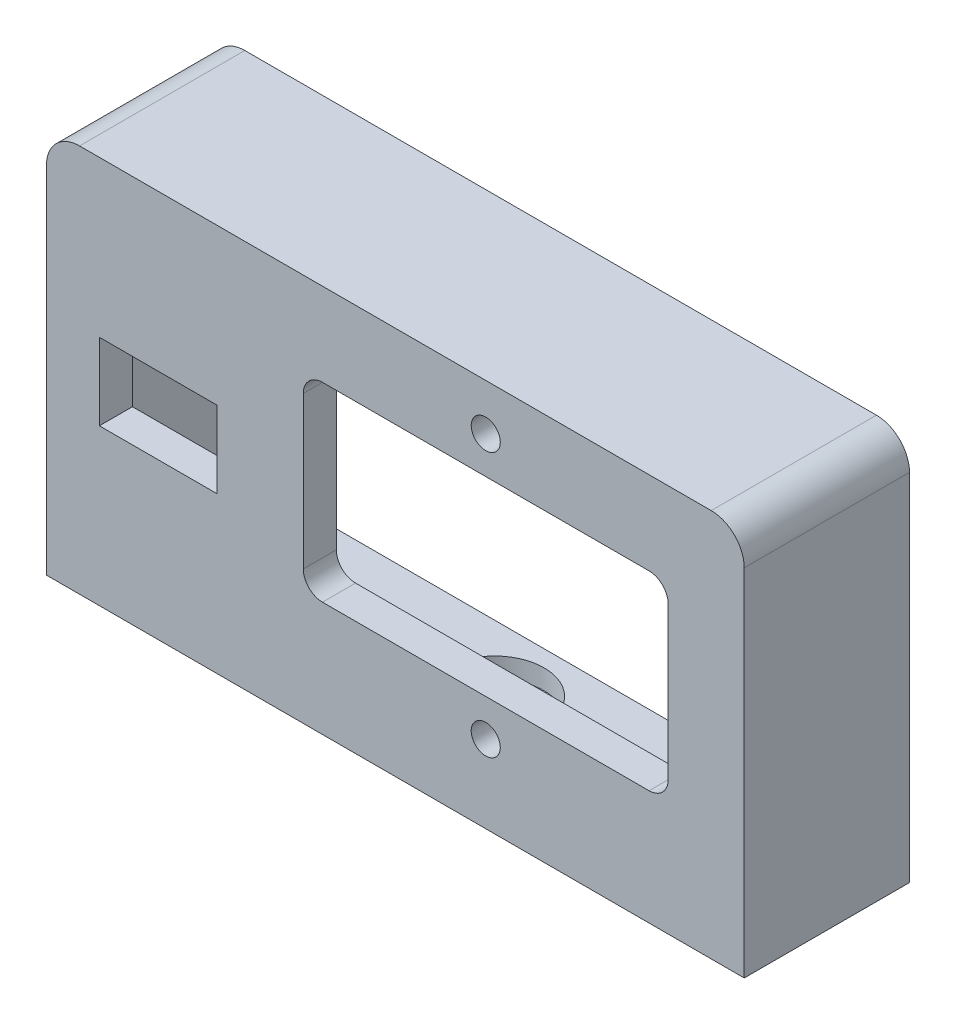
ISO-10303-21;
HEADER;
FILE_DESCRIPTION(('STEP AP214'),'2;1');
FILE_NAME('part.step','',(''),(''),'','','');
FILE_SCHEMA(('AUTOMOTIVE_DESIGN { 1 0 10303 214 1 1 1 1 }'));
ENDSEC;
DATA;
#1=APPLICATION_CONTEXT('core data for automotive mechanical design processes');
#2=APPLICATION_PROTOCOL_DEFINITION('international standard','automotive_design',2000,#1);
#3=PRODUCT_CONTEXT('',#1,'mechanical');
#4=PRODUCT('Part','Part','',(#3));
#5=PRODUCT_RELATED_PRODUCT_CATEGORY('part','',(#4));
#6=PRODUCT_DEFINITION_FORMATION('','',#4);
#7=PRODUCT_DEFINITION_CONTEXT('part definition',#1,'design');
#8=PRODUCT_DEFINITION('design','',#6,#7);
#9=PRODUCT_DEFINITION_SHAPE('','',#8);
#10=(LENGTH_UNIT() NAMED_UNIT(*) SI_UNIT(.MILLI.,.METRE.));
#11=(NAMED_UNIT(*) PLANE_ANGLE_UNIT() SI_UNIT($,.RADIAN.));
#12=(NAMED_UNIT(*) SI_UNIT($,.STERADIAN.) SOLID_ANGLE_UNIT());
#13=UNCERTAINTY_MEASURE_WITH_UNIT(LENGTH_MEASURE(1.E-05),#10,'distance_accuracy_value','');
#14=(GEOMETRIC_REPRESENTATION_CONTEXT(3) GLOBAL_UNCERTAINTY_ASSIGNED_CONTEXT((#13)) GLOBAL_UNIT_ASSIGNED_CONTEXT((#10,
#11,#12)) REPRESENTATION_CONTEXT('',''));
#15=CARTESIAN_POINT('',(0.,0.,0.));
#16=DIRECTION('',(0.,0.,1.));
#17=DIRECTION('',(1.,0.,0.));
#18=AXIS2_PLACEMENT_3D('',#15,#16,#17);
#19=CARTESIAN_POINT('',(0.,0.,5.));
#20=DIRECTION('',(0.,0.,1.));
#21=DIRECTION('',(1.,0.,0.));
#22=AXIS2_PLACEMENT_3D('',#19,#20,#21);
#23=PLANE('',#22);
#24=DIRECTION('',(0.,-1.,0.));
#25=VECTOR('',#24,1.);
#26=CARTESIAN_POINT('',(-39.8681999570055,-54.3939858142769,5.));
#27=LINE('',#26,#25);
#28=CARTESIAN_POINT('',(-39.8681999570055,-54.3939858142769,5.));
#29=VERTEX_POINT('',#28);
#30=CARTESIAN_POINT('',(-39.8681999570055,-65.9939858142769,5.));
#31=VERTEX_POINT('',#30);
#32=EDGE_CURVE('E270',#29,#31,#27,.T.);
#33=ORIENTED_EDGE('',*,*,#32,.F.);
#34=DIRECTION('',(-1.,0.,0.));
#35=VECTOR('',#34,1.);
#36=CARTESIAN_POINT('',(-39.8681999570055,-54.3939858142769,5.));
#37=LINE('',#36,#35);
#38=CARTESIAN_POINT('',(-22.0681999570055,-54.3939858142769,5.));
#39=VERTEX_POINT('',#38);
#40=EDGE_CURVE('E278',#39,#29,#37,.T.);
#41=ORIENTED_EDGE('',*,*,#40,.F.);
#42=DIRECTION('',(0.,1.,0.));
#43=VECTOR('',#42,1.);
#44=CARTESIAN_POINT('',(-22.0681999570055,-54.3939858142769,5.));
#45=LINE('',#44,#43);
#46=CARTESIAN_POINT('',(-22.0681999570055,-65.9939858142769,5.));
#47=VERTEX_POINT('',#46);
#48=EDGE_CURVE('E275',#47,#39,#45,.T.);
#49=ORIENTED_EDGE('',*,*,#48,.F.);
#50=DIRECTION('',(1.,0.,0.));
#51=VECTOR('',#50,1.);
#52=CARTESIAN_POINT('',(-39.8681999570055,-65.9939858142769,5.));
#53=LINE('',#52,#51);
#54=EDGE_CURVE('E272',#31,#47,#53,.T.);
#55=ORIENTED_EDGE('',*,*,#54,.F.);
#56=EDGE_LOOP('',(#33,#41,#49,#55));
#57=FACE_BOUND('',#56,.T.);
#58=CARTESIAN_POINT('',(18.5761728789657,-37.8258913010359,5.));
#59=DIRECTION('',(0.,0.,1.));
#60=DIRECTION('',(1.,0.,0.));
#61=AXIS2_PLACEMENT_3D('',#58,#59,#60);
#62=CIRCLE('',#61,2.2);
#63=CARTESIAN_POINT('',(20.7761728789657,-37.8258913010359,5.));
#64=VERTEX_POINT('',#63);
#65=EDGE_CURVE('E356',#64,#64,#62,.T.);
#66=ORIENTED_EDGE('',*,*,#65,.F.);
#67=EDGE_LOOP('',(#66));
#68=FACE_BOUND('',#67,.T.);
#69=DIRECTION('',(0.,1.,0.));
#70=VECTOR('',#69,1.);
#71=CARTESIAN_POINT('',(57.6761728789657,-30.8258913010359,5.));
#72=LINE('',#71,#70);
#73=CARTESIAN_POINT('',(57.6761728789657,-89.5620803275179,5.));
#74=VERTEX_POINT('',#73);
#75=CARTESIAN_POINT('',(57.6761728789657,-35.8258913010359,5.));
#76=VERTEX_POINT('',#75);
#77=EDGE_CURVE('E365',#74,#76,#72,.T.);
#78=ORIENTED_EDGE('',*,*,#77,.T.);
#79=CARTESIAN_POINT('',(52.6761728789657,-35.8258913010359,5.));
#80=DIRECTION('',(0.,0.,1.));
#81=DIRECTION('',(1.,0.,0.));
#82=AXIS2_PLACEMENT_3D('',#79,#80,#81);
#83=CIRCLE('',#82,5.);
#84=CARTESIAN_POINT('',(52.6761728789657,-30.8258913010359,5.));
#85=VERTEX_POINT('',#84);
#86=EDGE_CURVE('E42',#76,#85,#83,.T.);
#87=ORIENTED_EDGE('',*,*,#86,.T.);
#88=DIRECTION('',(-1.,0.,0.));
#89=VECTOR('',#88,1.);
#90=CARTESIAN_POINT('',(-47.8681999570055,-30.8258913010359,5.));
#91=LINE('',#90,#89);
#92=CARTESIAN_POINT('',(-42.8681999570055,-30.8258913010359,5.));
#93=VERTEX_POINT('',#92);
#94=EDGE_CURVE('E368',#85,#93,#91,.T.);
#95=ORIENTED_EDGE('',*,*,#94,.T.);
#96=CARTESIAN_POINT('',(-42.8681999570055,-35.8258913010359,5.));
#97=DIRECTION('',(0.,0.,1.));
#98=DIRECTION('',(1.,0.,0.));
#99=AXIS2_PLACEMENT_3D('',#96,#97,#98);
#100=CIRCLE('',#99,5.);
#101=CARTESIAN_POINT('',(-47.8681999570055,-35.8258913010359,5.));
#102=VERTEX_POINT('',#101);
#103=EDGE_CURVE('E57',#93,#102,#100,.T.);
#104=ORIENTED_EDGE('',*,*,#103,.T.);
#105=DIRECTION('',(0.,-1.,0.));
#106=VECTOR('',#105,1.);
#107=CARTESIAN_POINT('',(-47.8681999570055,-30.8258913010359,5.));
#108=LINE('',#107,#106);
#109=CARTESIAN_POINT('',(-47.8681999570055,-89.5620803275179,5.));
#110=VERTEX_POINT('',#109);
#111=EDGE_CURVE('E359',#102,#110,#108,.T.);
#112=ORIENTED_EDGE('',*,*,#111,.T.);
#113=DIRECTION('',(1.,0.,0.));
#114=VECTOR('',#113,1.);
#115=CARTESIAN_POINT('',(-47.8681999570055,-89.5620803275179,5.));
#116=LINE('',#115,#114);
#117=EDGE_CURVE('E363',#110,#74,#116,.T.);
#118=ORIENTED_EDGE('',*,*,#117,.T.);
#119=EDGE_LOOP('',(#78,#87,#95,#104,#112,#118));
#120=FACE_BOUND('',#119,.T.);
#121=CARTESIAN_POINT('',(18.5761728789657,-77.8258913010359,5.));
#122=DIRECTION('',(0.,0.,1.));
#123=DIRECTION('',(1.,0.,0.));
#124=AXIS2_PLACEMENT_3D('',#121,#122,#123);
#125=CIRCLE('',#124,2.2);
#126=CARTESIAN_POINT('',(20.7761728789657,-77.8258913010359,5.));
#127=VERTEX_POINT('',#126);
#128=EDGE_CURVE('E350',#127,#127,#125,.T.);
#129=ORIENTED_EDGE('',*,*,#128,.F.);
#130=EDGE_LOOP('',(#129));
#131=FACE_BOUND('',#130,.T.);
#132=DIRECTION('',(0.,-1.,0.));
#133=VECTOR('',#132,1.);
#134=CARTESIAN_POINT('',(-9.02382712103428,-46.3258913010359,5.));
#135=LINE('',#134,#133);
#136=CARTESIAN_POINT('',(-9.02382712103428,-46.3258913010359,5.));
#137=VERTEX_POINT('',#136);
#138=CARTESIAN_POINT('',(-9.02382712103428,-69.3258913010359,5.));
#139=VERTEX_POINT('',#138);
#140=EDGE_CURVE('E293',#137,#139,#135,.T.);
#141=ORIENTED_EDGE('',*,*,#140,.F.);
#142=CARTESIAN_POINT('',(-6.12382712103428,-46.3258913010359,5.));
#143=DIRECTION('',(0.,0.,1.));
#144=DIRECTION('',(1.,0.,0.));
#145=AXIS2_PLACEMENT_3D('',#142,#143,#144);
#146=CIRCLE('',#145,2.9);
#147=CARTESIAN_POINT('',(-6.12382712103428,-43.4258913010359,5.));
#148=VERTEX_POINT('',#147);
#149=EDGE_CURVE('E291',#148,#137,#146,.T.);
#150=ORIENTED_EDGE('',*,*,#149,.F.);
#151=DIRECTION('',(-1.,0.,0.));
#152=VECTOR('',#151,1.);
#153=CARTESIAN_POINT('',(43.2761728789657,-43.4258913010359,5.));
#154=LINE('',#153,#152);
#155=CARTESIAN_POINT('',(43.2761728789657,-43.4258913010359,5.));
#156=VERTEX_POINT('',#155);
#157=EDGE_CURVE('E307',#156,#148,#154,.T.);
#158=ORIENTED_EDGE('',*,*,#157,.F.);
#159=CARTESIAN_POINT('',(43.2761728789657,-46.3258913010359,5.));
#160=DIRECTION('',(0.,0.,1.));
#161=DIRECTION('',(1.,0.,0.));
#162=AXIS2_PLACEMENT_3D('',#159,#160,#161);
#163=CIRCLE('',#162,2.9);
#164=CARTESIAN_POINT('',(46.1761728789657,-46.3258913010359,5.));
#165=VERTEX_POINT('',#164);
#166=EDGE_CURVE('E304',#165,#156,#163,.T.);
#167=ORIENTED_EDGE('',*,*,#166,.F.);
#168=DIRECTION('',(0.,1.,0.));
#169=VECTOR('',#168,1.);
#170=CARTESIAN_POINT('',(46.1761728789657,-69.3258913010359,5.));
#171=LINE('',#170,#169);
#172=CARTESIAN_POINT('',(46.1761728789657,-69.3258913010359,5.));
#173=VERTEX_POINT('',#172);
#174=EDGE_CURVE('E302',#173,#165,#171,.T.);
#175=ORIENTED_EDGE('',*,*,#174,.F.);
#176=CARTESIAN_POINT('',(43.2761728789657,-69.3258913010359,5.));
#177=DIRECTION('',(0.,0.,1.));
#178=DIRECTION('',(1.,0.,0.));
#179=AXIS2_PLACEMENT_3D('',#176,#177,#178);
#180=CIRCLE('',#179,2.9);
#181=CARTESIAN_POINT('',(43.2761728789657,-72.2258913010359,5.));
#182=VERTEX_POINT('',#181);
#183=EDGE_CURVE('E300',#182,#173,#180,.T.);
#184=ORIENTED_EDGE('',*,*,#183,.F.);
#185=DIRECTION('',(1.,0.,0.));
#186=VECTOR('',#185,1.);
#187=CARTESIAN_POINT('',(-6.12382712103428,-72.2258913010359,5.));
#188=LINE('',#187,#186);
#189=CARTESIAN_POINT('',(-6.12382712103428,-72.2258913010359,5.));
#190=VERTEX_POINT('',#189);
#191=EDGE_CURVE('E298',#190,#182,#188,.T.);
#192=ORIENTED_EDGE('',*,*,#191,.F.);
#193=CARTESIAN_POINT('',(-6.12382712103428,-69.3258913010359,5.));
#194=DIRECTION('',(0.,0.,1.));
#195=DIRECTION('',(1.,0.,0.));
#196=AXIS2_PLACEMENT_3D('',#193,#194,#195);
#197=CIRCLE('',#196,2.9);
#198=EDGE_CURVE('E296',#139,#190,#197,.T.);
#199=ORIENTED_EDGE('',*,*,#198,.F.);
#200=EDGE_LOOP('',(#141,#150,#158,#167,#175,#184,#192,#199));
#201=FACE_BOUND('',#200,.T.);
#202=ADVANCED_FACE('F34',(#57,#68,#120,#131,#201),#23,.T.);
#203=CARTESIAN_POINT('',(0.,0.,0.));
#204=DIRECTION('',(0.,0.,1.));
#205=DIRECTION('',(1.,0.,0.));
#206=AXIS2_PLACEMENT_3D('',#203,#204,#205);
#207=PLANE('',#206);
#208=DIRECTION('',(0.,1.,0.));
#209=VECTOR('',#208,1.);
#210=CARTESIAN_POINT('',(-44.8681999570055,-86.5620803275179,0.));
#211=LINE('',#210,#209);
#212=CARTESIAN_POINT('',(-44.8681999570055,-86.5620803275179,0.));
#213=VERTEX_POINT('',#212);
#214=CARTESIAN_POINT('',(-44.8681999570055,-35.8258913010359,0.));
#215=VERTEX_POINT('',#214);
#216=EDGE_CURVE('E205',#213,#215,#211,.T.);
#217=ORIENTED_EDGE('',*,*,#216,.T.);
#218=CARTESIAN_POINT('',(-42.8681999570055,-35.8258913010359,0.));
#219=DIRECTION('',(0.,0.,-1.));
#220=DIRECTION('',(-1.,0.,0.));
#221=AXIS2_PLACEMENT_3D('',#218,#219,#220);
#222=CIRCLE('',#221,1.99999999999999);
#223=CARTESIAN_POINT('',(-42.8681999570055,-33.8258913010359,0.));
#224=VERTEX_POINT('',#223);
#225=EDGE_CURVE('E230',#215,#224,#222,.T.);
#226=ORIENTED_EDGE('',*,*,#225,.T.);
#227=DIRECTION('',(1.,0.,0.));
#228=VECTOR('',#227,1.);
#229=CARTESIAN_POINT('',(-42.8681999570055,-33.8258913010359,0.));
#230=LINE('',#229,#228);
#231=CARTESIAN_POINT('',(52.6761728789658,-33.8258913010359,0.));
#232=VERTEX_POINT('',#231);
#233=EDGE_CURVE('E211',#224,#232,#230,.T.);
#234=ORIENTED_EDGE('',*,*,#233,.T.);
#235=CARTESIAN_POINT('',(52.6761728789657,-35.8258913010359,0.));
#236=DIRECTION('',(0.,0.,-1.));
#237=DIRECTION('',(-1.,0.,0.));
#238=AXIS2_PLACEMENT_3D('',#235,#236,#237);
#239=CIRCLE('',#238,1.99999999999999);
#240=CARTESIAN_POINT('',(54.6761728789657,-35.8258913010359,0.));
#241=VERTEX_POINT('',#240);
#242=EDGE_CURVE('E234',#232,#241,#239,.T.);
#243=ORIENTED_EDGE('',*,*,#242,.T.);
#244=DIRECTION('',(0.,-1.,0.));
#245=VECTOR('',#244,1.);
#246=CARTESIAN_POINT('',(54.6761728789657,-35.8258913010359,0.));
#247=LINE('',#246,#245);
#248=CARTESIAN_POINT('',(54.6761728789657,-86.5620803275179,0.));
#249=VERTEX_POINT('',#248);
#250=EDGE_CURVE('E237',#241,#249,#247,.T.);
#251=ORIENTED_EDGE('',*,*,#250,.T.);
#252=DIRECTION('',(-1.,0.,0.));
#253=VECTOR('',#252,1.);
#254=CARTESIAN_POINT('',(54.6761728789657,-86.5620803275179,0.));
#255=LINE('',#254,#253);
#256=EDGE_CURVE('E240',#249,#213,#255,.T.);
#257=ORIENTED_EDGE('',*,*,#256,.T.);
#258=EDGE_LOOP('',(#217,#226,#234,#243,#251,#257));
#259=FACE_BOUND('',#258,.T.);
#260=DIRECTION('',(-1.,0.,0.));
#261=VECTOR('',#260,1.);
#262=CARTESIAN_POINT('',(0.,-54.3939858142769,0.));
#263=LINE('',#262,#261);
#264=CARTESIAN_POINT('',(-22.0681999570055,-54.3939858142769,0.));
#265=VERTEX_POINT('',#264);
#266=CARTESIAN_POINT('',(-39.8681999570055,-54.3939858142769,0.));
#267=VERTEX_POINT('',#266);
#268=EDGE_CURVE('E380',#265,#267,#263,.T.);
#269=ORIENTED_EDGE('',*,*,#268,.T.);
#270=DIRECTION('',(0.,-1.,0.));
#271=VECTOR('',#270,1.);
#272=CARTESIAN_POINT('',(-39.8681999570055,0.,0.));
#273=LINE('',#272,#271);
#274=CARTESIAN_POINT('',(-39.8681999570055,-65.9939858142769,0.));
#275=VERTEX_POINT('',#274);
#276=EDGE_CURVE('E383',#267,#275,#273,.T.);
#277=ORIENTED_EDGE('',*,*,#276,.T.);
#278=DIRECTION('',(1.,0.,0.));
#279=VECTOR('',#278,1.);
#280=CARTESIAN_POINT('',(0.,-65.9939858142769,0.));
#281=LINE('',#280,#279);
#282=CARTESIAN_POINT('',(-22.0681999570055,-65.9939858142769,0.));
#283=VERTEX_POINT('',#282);
#284=EDGE_CURVE('E374',#275,#283,#281,.T.);
#285=ORIENTED_EDGE('',*,*,#284,.T.);
#286=DIRECTION('',(0.,1.,0.));
#287=VECTOR('',#286,1.);
#288=CARTESIAN_POINT('',(-22.0681999570055,0.,0.));
#289=LINE('',#288,#287);
#290=EDGE_CURVE('E377',#283,#265,#289,.T.);
#291=ORIENTED_EDGE('',*,*,#290,.T.);
#292=EDGE_LOOP('',(#269,#277,#285,#291));
#293=FACE_BOUND('',#292,.T.);
#294=CARTESIAN_POINT('',(18.5761728789657,-77.8258913010359,0.));
#295=DIRECTION('',(0.,0.,1.));
#296=DIRECTION('',(1.,0.,0.));
#297=AXIS2_PLACEMENT_3D('',#294,#295,#296);
#298=CIRCLE('',#297,2.2);
#299=CARTESIAN_POINT('',(20.7761728789657,-77.8258913010359,0.));
#300=VERTEX_POINT('',#299);
#301=EDGE_CURVE('E349',#300,#300,#298,.T.);
#302=ORIENTED_EDGE('',*,*,#301,.T.);
#303=EDGE_LOOP('',(#302));
#304=FACE_BOUND('',#303,.T.);
#305=CARTESIAN_POINT('',(18.5761728789657,-37.8258913010359,0.));
#306=DIRECTION('',(0.,0.,1.));
#307=DIRECTION('',(1.,0.,0.));
#308=AXIS2_PLACEMENT_3D('',#305,#306,#307);
#309=CIRCLE('',#308,2.2);
#310=CARTESIAN_POINT('',(20.7761728789657,-37.8258913010359,0.));
#311=VERTEX_POINT('',#310);
#312=EDGE_CURVE('E353',#311,#311,#309,.T.);
#313=ORIENTED_EDGE('',*,*,#312,.T.);
#314=EDGE_LOOP('',(#313));
#315=FACE_BOUND('',#314,.T.);
#316=CARTESIAN_POINT('',(-6.12382712103428,-46.3258913010359,0.));
#317=DIRECTION('',(0.,0.,1.));
#318=DIRECTION('',(1.,0.,0.));
#319=AXIS2_PLACEMENT_3D('',#316,#317,#318);
#320=CIRCLE('',#319,2.9);
#321=CARTESIAN_POINT('',(-6.12382712103428,-43.4258913010359,0.));
#322=VERTEX_POINT('',#321);
#323=CARTESIAN_POINT('',(-9.02382712103428,-46.3258913010359,0.));
#324=VERTEX_POINT('',#323);
#325=EDGE_CURVE('E284',#322,#324,#320,.T.);
#326=ORIENTED_EDGE('',*,*,#325,.T.);
#327=DIRECTION('',(0.,-1.,0.));
#328=VECTOR('',#327,1.);
#329=CARTESIAN_POINT('',(-9.02382712103428,-46.3258913010359,0.));
#330=LINE('',#329,#328);
#331=CARTESIAN_POINT('',(-9.02382712103428,-69.3258913010359,0.));
#332=VERTEX_POINT('',#331);
#333=EDGE_CURVE('E312',#324,#332,#330,.T.);
#334=ORIENTED_EDGE('',*,*,#333,.T.);
#335=CARTESIAN_POINT('',(-6.12382712103428,-69.3258913010359,0.));
#336=DIRECTION('',(0.,0.,1.));
#337=DIRECTION('',(1.,0.,0.));
#338=AXIS2_PLACEMENT_3D('',#335,#336,#337);
#339=CIRCLE('',#338,2.9);
#340=CARTESIAN_POINT('',(-6.12382712103428,-72.2258913010359,0.));
#341=VERTEX_POINT('',#340);
#342=EDGE_CURVE('E315',#332,#341,#339,.T.);
#343=ORIENTED_EDGE('',*,*,#342,.T.);
#344=DIRECTION('',(1.,0.,0.));
#345=VECTOR('',#344,1.);
#346=CARTESIAN_POINT('',(-6.12382712103428,-72.2258913010359,0.));
#347=LINE('',#346,#345);
#348=CARTESIAN_POINT('',(43.2761728789657,-72.2258913010359,0.));
#349=VERTEX_POINT('',#348);
#350=EDGE_CURVE('E318',#341,#349,#347,.T.);
#351=ORIENTED_EDGE('',*,*,#350,.T.);
#352=CARTESIAN_POINT('',(43.2761728789657,-69.3258913010359,0.));
#353=DIRECTION('',(0.,0.,1.));
#354=DIRECTION('',(1.,0.,0.));
#355=AXIS2_PLACEMENT_3D('',#352,#353,#354);
#356=CIRCLE('',#355,2.9);
#357=CARTESIAN_POINT('',(46.1761728789657,-69.3258913010359,0.));
#358=VERTEX_POINT('',#357);
#359=EDGE_CURVE('E321',#349,#358,#356,.T.);
#360=ORIENTED_EDGE('',*,*,#359,.T.);
#361=DIRECTION('',(0.,1.,0.));
#362=VECTOR('',#361,1.);
#363=CARTESIAN_POINT('',(46.1761728789657,-69.3258913010359,0.));
#364=LINE('',#363,#362);
#365=CARTESIAN_POINT('',(46.1761728789657,-46.3258913010359,0.));
#366=VERTEX_POINT('',#365);
#367=EDGE_CURVE('E324',#358,#366,#364,.T.);
#368=ORIENTED_EDGE('',*,*,#367,.T.);
#369=CARTESIAN_POINT('',(43.2761728789657,-46.3258913010359,0.));
#370=DIRECTION('',(0.,0.,1.));
#371=DIRECTION('',(1.,0.,0.));
#372=AXIS2_PLACEMENT_3D('',#369,#370,#371);
#373=CIRCLE('',#372,2.9);
#374=CARTESIAN_POINT('',(43.2761728789657,-43.4258913010359,0.));
#375=VERTEX_POINT('',#374);
#376=EDGE_CURVE('E327',#366,#375,#373,.T.);
#377=ORIENTED_EDGE('',*,*,#376,.T.);
#378=DIRECTION('',(-1.,0.,0.));
#379=VECTOR('',#378,1.);
#380=CARTESIAN_POINT('',(43.2761728789657,-43.4258913010359,0.));
#381=LINE('',#380,#379);
#382=EDGE_CURVE('E294',#375,#322,#381,.T.);
#383=ORIENTED_EDGE('',*,*,#382,.T.);
#384=EDGE_LOOP('',(#326,#334,#343,#351,#360,#368,#377,#383));
#385=FACE_BOUND('',#384,.T.);
#386=ADVANCED_FACE('F427',(#259,#293,#304,#315,#385),#207,.F.);
#387=CARTESIAN_POINT('',(-47.8681999570055,-30.8258913010359,5.));
#388=DIRECTION('',(1.,0.,0.));
#389=DIRECTION('',(0.,0.,-1.));
#390=AXIS2_PLACEMENT_3D('',#387,#388,#389);
#391=PLANE('',#390);
#392=ORIENTED_EDGE('',*,*,#111,.F.);
#393=DIRECTION('',(0.,0.,-1.));
#394=VECTOR('',#393,1.);
#395=CARTESIAN_POINT('',(-47.8681999570055,-35.8258913010359,5.));
#396=LINE('',#395,#394);
#397=CARTESIAN_POINT('',(-47.8681999570055,-35.8258913010359,-20.));
#398=VERTEX_POINT('',#397);
#399=EDGE_CURVE('E11',#102,#398,#396,.T.);
#400=ORIENTED_EDGE('',*,*,#399,.T.);
#401=DIRECTION('',(0.,1.,0.));
#402=VECTOR('',#401,1.);
#403=CARTESIAN_POINT('',(-47.8681999570055,-89.5620803275179,-20.));
#404=LINE('',#403,#402);
#405=CARTESIAN_POINT('',(-47.8681999570055,-89.5620803275179,-20.));
#406=VERTEX_POINT('',#405);
#407=EDGE_CURVE('E267',#406,#398,#404,.T.);
#408=ORIENTED_EDGE('',*,*,#407,.F.);
#409=DIRECTION('',(0.,0.,-1.));
#410=VECTOR('',#409,1.);
#411=CARTESIAN_POINT('',(-47.8681999570055,-89.5620803275179,5.));
#412=LINE('',#411,#410);
#413=EDGE_CURVE('E372',#110,#406,#412,.T.);
#414=ORIENTED_EDGE('',*,*,#413,.F.);
#415=EDGE_LOOP('',(#392,#400,#408,#414));
#416=FACE_BOUND('',#415,.T.);
#417=ADVANCED_FACE('F416',(#416),#391,.F.);
#418=CARTESIAN_POINT('',(-47.8681999570055,-89.5620803275179,5.));
#419=DIRECTION('',(0.,1.,0.));
#420=DIRECTION('',(0.,0.,1.));
#421=AXIS2_PLACEMENT_3D('',#418,#419,#420);
#422=PLANE('',#421);
#423=CARTESIAN_POINT('',(4.90398646098012,-89.5620803275179,-10.));
#424=DIRECTION('',(0.,1.,0.));
#425=DIRECTION('',(0.,0.,1.));
#426=AXIS2_PLACEMENT_3D('',#423,#424,#425);
#427=CIRCLE('',#426,7.5);
#428=CARTESIAN_POINT('',(4.90398646098012,-89.5620803275179,-2.5));
#429=VERTEX_POINT('',#428);
#430=EDGE_CURVE('E741',#429,#429,#427,.T.);
#431=ORIENTED_EDGE('',*,*,#430,.T.);
#432=EDGE_LOOP('',(#431));
#433=FACE_BOUND('',#432,.T.);
#434=CARTESIAN_POINT('',(29.645811083526,-89.5620803275179,-10.0286053097989));
#435=DIRECTION('',(0.,1.,0.));
#436=DIRECTION('',(0.,0.,1.));
#437=AXIS2_PLACEMENT_3D('',#434,#435,#436);
#438=CIRCLE('',#437,1.25);
#439=CARTESIAN_POINT('',(29.645811083526,-89.5620803275179,-8.77860530979888));
#440=VERTEX_POINT('',#439);
#441=EDGE_CURVE('E734',#440,#440,#438,.T.);
#442=ORIENTED_EDGE('',*,*,#441,.T.);
#443=EDGE_LOOP('',(#442));
#444=FACE_BOUND('',#443,.T.);
#445=CARTESIAN_POINT('',(-19.913744380915,-89.5620803275179,-10.0286053097989));
#446=DIRECTION('',(0.,1.,0.));
#447=DIRECTION('',(0.,0.,1.));
#448=AXIS2_PLACEMENT_3D('',#445,#446,#447);
#449=CIRCLE('',#448,1.25);
#450=CARTESIAN_POINT('',(-19.913744380915,-89.5620803275179,-8.77860530979888));
#451=VERTEX_POINT('',#450);
#452=EDGE_CURVE('E232',#451,#451,#449,.T.);
#453=ORIENTED_EDGE('',*,*,#452,.T.);
#454=EDGE_LOOP('',(#453));
#455=FACE_BOUND('',#454,.T.);
#456=ORIENTED_EDGE('',*,*,#413,.T.);
#457=DIRECTION('',(-1.,0.,0.));
#458=VECTOR('',#457,1.);
#459=CARTESIAN_POINT('',(57.6761728789657,-89.5620803275179,-20.));
#460=LINE('',#459,#458);
#461=CARTESIAN_POINT('',(57.6761728789657,-89.5620803275179,-20.));
#462=VERTEX_POINT('',#461);
#463=EDGE_CURVE('E264',#462,#406,#460,.T.);
#464=ORIENTED_EDGE('',*,*,#463,.F.);
#465=DIRECTION('',(0.,0.,-1.));
#466=VECTOR('',#465,1.);
#467=CARTESIAN_POINT('',(57.6761728789657,-89.5620803275179,5.));
#468=LINE('',#467,#466);
#469=EDGE_CURVE('E370',#74,#462,#468,.T.);
#470=ORIENTED_EDGE('',*,*,#469,.F.);
#471=ORIENTED_EDGE('',*,*,#117,.F.);
#472=EDGE_LOOP('',(#456,#464,#470,#471));
#473=FACE_BOUND('',#472,.T.);
#474=ADVANCED_FACE('F411',(#433,#444,#455,#473),#422,.F.);
#475=CARTESIAN_POINT('',(57.6761728789657,-30.8258913010359,5.));
#476=DIRECTION('',(-1.,0.,0.));
#477=DIRECTION('',(0.,-1.,0.));
#478=AXIS2_PLACEMENT_3D('',#475,#476,#477);
#479=PLANE('',#478);
#480=ORIENTED_EDGE('',*,*,#469,.T.);
#481=DIRECTION('',(0.,-1.,0.));
#482=VECTOR('',#481,1.);
#483=CARTESIAN_POINT('',(57.6761728789657,-35.8258913010359,-20.));
#484=LINE('',#483,#482);
#485=CARTESIAN_POINT('',(57.6761728789657,-35.8258913010359,-20.));
#486=VERTEX_POINT('',#485);
#487=EDGE_CURVE('E261',#486,#462,#484,.T.);
#488=ORIENTED_EDGE('',*,*,#487,.F.);
#489=DIRECTION('',(0.,0.,-1.));
#490=VECTOR('',#489,1.);
#491=CARTESIAN_POINT('',(57.6761728789657,-35.8258913010359,5.));
#492=LINE('',#491,#490);
#493=EDGE_CURVE('E390',#486,#76,#492,.F.);
#494=ORIENTED_EDGE('',*,*,#493,.T.);
#495=ORIENTED_EDGE('',*,*,#77,.F.);
#496=EDGE_LOOP('',(#480,#488,#494,#495));
#497=FACE_BOUND('',#496,.T.);
#498=ADVANCED_FACE('F407',(#497),#479,.F.);
#499=CARTESIAN_POINT('',(-47.8681999570055,-30.8258913010359,5.));
#500=DIRECTION('',(0.,-1.,0.));
#501=DIRECTION('',(0.,0.,-1.));
#502=AXIS2_PLACEMENT_3D('',#499,#500,#501);
#503=PLANE('',#502);
#504=ORIENTED_EDGE('',*,*,#94,.F.);
#505=DIRECTION('',(0.,0.,-1.));
#506=VECTOR('',#505,1.);
#507=CARTESIAN_POINT('',(52.6761728789657,-30.8258913010359,5.));
#508=LINE('',#507,#506);
#509=CARTESIAN_POINT('',(52.6761728789657,-30.8258913010359,-20.));
#510=VERTEX_POINT('',#509);
#511=EDGE_CURVE('E388',#85,#510,#508,.T.);
#512=ORIENTED_EDGE('',*,*,#511,.T.);
#513=DIRECTION('',(1.,0.,0.));
#514=VECTOR('',#513,1.);
#515=CARTESIAN_POINT('',(-42.8681999570055,-30.8258913010359,-20.));
#516=LINE('',#515,#514);
#517=CARTESIAN_POINT('',(-42.8681999570055,-30.8258913010359,-20.));
#518=VERTEX_POINT('',#517);
#519=EDGE_CURVE('E255',#518,#510,#516,.T.);
#520=ORIENTED_EDGE('',*,*,#519,.F.);
#521=DIRECTION('',(0.,0.,-1.));
#522=VECTOR('',#521,1.);
#523=CARTESIAN_POINT('',(-42.8681999570055,-30.8258913010359,5.));
#524=LINE('',#523,#522);
#525=EDGE_CURVE('E386',#518,#93,#524,.F.);
#526=ORIENTED_EDGE('',*,*,#525,.T.);
#527=EDGE_LOOP('',(#504,#512,#520,#526));
#528=FACE_BOUND('',#527,.T.);
#529=ADVANCED_FACE('F399',(#528),#503,.F.);
#530=CARTESIAN_POINT('',(18.5761728789657,-37.8258913010359,5.));
#531=DIRECTION('',(0.,0.,-1.));
#532=DIRECTION('',(-1.,0.,0.));
#533=AXIS2_PLACEMENT_3D('',#530,#531,#532);
#534=CYLINDRICAL_SURFACE('',#533,2.2);
#535=ORIENTED_EDGE('',*,*,#65,.T.);
#536=EDGE_LOOP('',(#535));
#537=FACE_BOUND('',#536,.T.);
#538=ORIENTED_EDGE('',*,*,#312,.F.);
#539=EDGE_LOOP('',(#538));
#540=FACE_BOUND('',#539,.T.);
#541=ADVANCED_FACE('F438',(#537,#540),#534,.F.);
#542=CARTESIAN_POINT('',(18.5761728789657,-77.8258913010359,5.));
#543=DIRECTION('',(0.,0.,-1.));
#544=DIRECTION('',(-1.,0.,0.));
#545=AXIS2_PLACEMENT_3D('',#542,#543,#544);
#546=CYLINDRICAL_SURFACE('',#545,2.2);
#547=ORIENTED_EDGE('',*,*,#128,.T.);
#548=EDGE_LOOP('',(#547));
#549=FACE_BOUND('',#548,.T.);
#550=ORIENTED_EDGE('',*,*,#301,.F.);
#551=EDGE_LOOP('',(#550));
#552=FACE_BOUND('',#551,.T.);
#553=ADVANCED_FACE('F474',(#549,#552),#546,.F.);
#554=CARTESIAN_POINT('',(-6.12382712103428,-46.3258913010359,5.));
#555=DIRECTION('',(0.,0.,-1.));
#556=DIRECTION('',(-1.,0.,0.));
#557=AXIS2_PLACEMENT_3D('',#554,#555,#556);
#558=CYLINDRICAL_SURFACE('',#557,2.9);
#559=ORIENTED_EDGE('',*,*,#325,.F.);
#560=DIRECTION('',(0.,0.,-1.));
#561=VECTOR('',#560,1.);
#562=CARTESIAN_POINT('',(-6.12382712103428,-43.4258913010359,5.));
#563=LINE('',#562,#561);
#564=EDGE_CURVE('E309',#148,#322,#563,.T.);
#565=ORIENTED_EDGE('',*,*,#564,.F.);
#566=ORIENTED_EDGE('',*,*,#149,.T.);
#567=DIRECTION('',(0.,0.,-1.));
#568=VECTOR('',#567,1.);
#569=CARTESIAN_POINT('',(-9.02382712103428,-46.3258913010359,5.));
#570=LINE('',#569,#568);
#571=EDGE_CURVE('E346',#137,#324,#570,.T.);
#572=ORIENTED_EDGE('',*,*,#571,.T.);
#573=EDGE_LOOP('',(#559,#565,#566,#572));
#574=FACE_BOUND('',#573,.T.);
#575=ADVANCED_FACE('F481',(#574),#558,.F.);
#576=CARTESIAN_POINT('',(-9.02382712103428,-46.3258913010359,5.));
#577=DIRECTION('',(1.,0.,0.));
#578=DIRECTION('',(0.,1.,0.));
#579=AXIS2_PLACEMENT_3D('',#576,#577,#578);
#580=PLANE('',#579);
#581=ORIENTED_EDGE('',*,*,#333,.F.);
#582=ORIENTED_EDGE('',*,*,#571,.F.);
#583=ORIENTED_EDGE('',*,*,#140,.T.);
#584=DIRECTION('',(0.,0.,-1.));
#585=VECTOR('',#584,1.);
#586=CARTESIAN_POINT('',(-9.02382712103428,-69.3258913010359,5.));
#587=LINE('',#586,#585);
#588=EDGE_CURVE('E344',#139,#332,#587,.T.);
#589=ORIENTED_EDGE('',*,*,#588,.T.);
#590=EDGE_LOOP('',(#581,#582,#583,#589));
#591=FACE_BOUND('',#590,.T.);
#592=ADVANCED_FACE('F488',(#591),#580,.T.);
#593=CARTESIAN_POINT('',(-6.12382712103428,-69.3258913010359,5.));
#594=DIRECTION('',(0.,0.,-1.));
#595=DIRECTION('',(-1.,0.,0.));
#596=AXIS2_PLACEMENT_3D('',#593,#594,#595);
#597=CYLINDRICAL_SURFACE('',#596,2.9);
#598=ORIENTED_EDGE('',*,*,#342,.F.);
#599=ORIENTED_EDGE('',*,*,#588,.F.);
#600=ORIENTED_EDGE('',*,*,#198,.T.);
#601=DIRECTION('',(0.,0.,-1.));
#602=VECTOR('',#601,1.);
#603=CARTESIAN_POINT('',(-6.12382712103428,-72.2258913010359,5.));
#604=LINE('',#603,#602);
#605=EDGE_CURVE('E342',#190,#341,#604,.T.);
#606=ORIENTED_EDGE('',*,*,#605,.T.);
#607=EDGE_LOOP('',(#598,#599,#600,#606));
#608=FACE_BOUND('',#607,.T.);
#609=ADVANCED_FACE('F496',(#608),#597,.F.);
#610=CARTESIAN_POINT('',(-6.12382712103428,-72.2258913010359,5.));
#611=DIRECTION('',(0.,1.,0.));
#612=DIRECTION('',(0.,0.,1.));
#613=AXIS2_PLACEMENT_3D('',#610,#611,#612);
#614=PLANE('',#613);
#615=ORIENTED_EDGE('',*,*,#350,.F.);
#616=ORIENTED_EDGE('',*,*,#605,.F.);
#617=ORIENTED_EDGE('',*,*,#191,.T.);
#618=DIRECTION('',(0.,0.,-1.));
#619=VECTOR('',#618,1.);
#620=CARTESIAN_POINT('',(43.2761728789657,-72.2258913010359,5.));
#621=LINE('',#620,#619);
#622=EDGE_CURVE('E340',#182,#349,#621,.T.);
#623=ORIENTED_EDGE('',*,*,#622,.T.);
#624=EDGE_LOOP('',(#615,#616,#617,#623));
#625=FACE_BOUND('',#624,.T.);
#626=ADVANCED_FACE('F504',(#625),#614,.T.);
#627=CARTESIAN_POINT('',(43.2761728789657,-69.3258913010359,5.));
#628=DIRECTION('',(0.,0.,-1.));
#629=DIRECTION('',(-1.,0.,0.));
#630=AXIS2_PLACEMENT_3D('',#627,#628,#629);
#631=CYLINDRICAL_SURFACE('',#630,2.9);
#632=ORIENTED_EDGE('',*,*,#359,.F.);
#633=ORIENTED_EDGE('',*,*,#622,.F.);
#634=ORIENTED_EDGE('',*,*,#183,.T.);
#635=DIRECTION('',(0.,0.,-1.));
#636=VECTOR('',#635,1.);
#637=CARTESIAN_POINT('',(46.1761728789657,-69.3258913010359,5.));
#638=LINE('',#637,#636);
#639=EDGE_CURVE('E338',#173,#358,#638,.T.);
#640=ORIENTED_EDGE('',*,*,#639,.T.);
#641=EDGE_LOOP('',(#632,#633,#634,#640));
#642=FACE_BOUND('',#641,.T.);
#643=ADVANCED_FACE('F512',(#642),#631,.F.);
#644=CARTESIAN_POINT('',(46.1761728789657,-69.3258913010359,5.));
#645=DIRECTION('',(-1.,0.,0.));
#646=DIRECTION('',(0.,0.,1.));
#647=AXIS2_PLACEMENT_3D('',#644,#645,#646);
#648=PLANE('',#647);
#649=ORIENTED_EDGE('',*,*,#367,.F.);
#650=ORIENTED_EDGE('',*,*,#639,.F.);
#651=ORIENTED_EDGE('',*,*,#174,.T.);
#652=DIRECTION('',(0.,0.,-1.));
#653=VECTOR('',#652,1.);
#654=CARTESIAN_POINT('',(46.1761728789657,-46.3258913010359,5.));
#655=LINE('',#654,#653);
#656=EDGE_CURVE('E336',#165,#366,#655,.T.);
#657=ORIENTED_EDGE('',*,*,#656,.T.);
#658=EDGE_LOOP('',(#649,#650,#651,#657));
#659=FACE_BOUND('',#658,.T.);
#660=ADVANCED_FACE('F520',(#659),#648,.T.);
#661=CARTESIAN_POINT('',(43.2761728789657,-46.3258913010359,5.));
#662=DIRECTION('',(0.,0.,-1.));
#663=DIRECTION('',(-1.,0.,0.));
#664=AXIS2_PLACEMENT_3D('',#661,#662,#663);
#665=CYLINDRICAL_SURFACE('',#664,2.9);
#666=ORIENTED_EDGE('',*,*,#376,.F.);
#667=ORIENTED_EDGE('',*,*,#656,.F.);
#668=ORIENTED_EDGE('',*,*,#166,.T.);
#669=DIRECTION('',(0.,0.,-1.));
#670=VECTOR('',#669,1.);
#671=CARTESIAN_POINT('',(43.2761728789657,-43.4258913010359,5.));
#672=LINE('',#671,#670);
#673=EDGE_CURVE('E334',#156,#375,#672,.T.);
#674=ORIENTED_EDGE('',*,*,#673,.T.);
#675=EDGE_LOOP('',(#666,#667,#668,#674));
#676=FACE_BOUND('',#675,.T.);
#677=ADVANCED_FACE('F528',(#676),#665,.F.);
#678=CARTESIAN_POINT('',(43.2761728789657,-43.4258913010359,5.));
#679=DIRECTION('',(0.,-1.,0.));
#680=DIRECTION('',(1.,0.,0.));
#681=AXIS2_PLACEMENT_3D('',#678,#679,#680);
#682=PLANE('',#681);
#683=ORIENTED_EDGE('',*,*,#382,.F.);
#684=ORIENTED_EDGE('',*,*,#673,.F.);
#685=ORIENTED_EDGE('',*,*,#157,.T.);
#686=ORIENTED_EDGE('',*,*,#564,.T.);
#687=EDGE_LOOP('',(#683,#684,#685,#686));
#688=FACE_BOUND('',#687,.T.);
#689=ADVANCED_FACE('F536',(#688),#682,.T.);
#690=CARTESIAN_POINT('',(-39.8681999570055,-54.3939858142769,-5.));
#691=DIRECTION('',(-1.,0.,0.));
#692=DIRECTION('',(0.,0.,1.));
#693=AXIS2_PLACEMENT_3D('',#690,#691,#692);
#694=PLANE('',#693);
#695=DIRECTION('',(0.,0.,1.));
#696=VECTOR('',#695,1.);
#697=CARTESIAN_POINT('',(-39.8681999570055,-54.3939858142769,-5.));
#698=LINE('',#697,#696);
#699=EDGE_CURVE('E282',#267,#29,#698,.T.);
#700=ORIENTED_EDGE('',*,*,#699,.T.);
#701=ORIENTED_EDGE('',*,*,#32,.T.);
#702=DIRECTION('',(0.,0.,1.));
#703=VECTOR('',#702,1.);
#704=CARTESIAN_POINT('',(-39.8681999570055,-65.9939858142769,-5.));
#705=LINE('',#704,#703);
#706=EDGE_CURVE('E281',#275,#31,#705,.T.);
#707=ORIENTED_EDGE('',*,*,#706,.F.);
#708=ORIENTED_EDGE('',*,*,#276,.F.);
#709=EDGE_LOOP('',(#700,#701,#707,#708));
#710=FACE_BOUND('',#709,.T.);
#711=ADVANCED_FACE('F544',(#710),#694,.F.);
#712=CARTESIAN_POINT('',(-39.8681999570055,-54.3939858142769,-5.));
#713=DIRECTION('',(0.,1.,0.));
#714=DIRECTION('',(0.,0.,1.));
#715=AXIS2_PLACEMENT_3D('',#712,#713,#714);
#716=PLANE('',#715);
#717=DIRECTION('',(0.,0.,1.));
#718=VECTOR('',#717,1.);
#719=CARTESIAN_POINT('',(-22.0681999570055,-54.3939858142769,-5.));
#720=LINE('',#719,#718);
#721=EDGE_CURVE('E285',#265,#39,#720,.T.);
#722=ORIENTED_EDGE('',*,*,#721,.T.);
#723=ORIENTED_EDGE('',*,*,#40,.T.);
#724=ORIENTED_EDGE('',*,*,#699,.F.);
#725=ORIENTED_EDGE('',*,*,#268,.F.);
#726=EDGE_LOOP('',(#722,#723,#724,#725));
#727=FACE_BOUND('',#726,.T.);
#728=ADVANCED_FACE('F552',(#727),#716,.F.);
#729=CARTESIAN_POINT('',(-22.0681999570055,-54.3939858142769,-5.));
#730=DIRECTION('',(1.,0.,0.));
#731=DIRECTION('',(0.,0.,-1.));
#732=AXIS2_PLACEMENT_3D('',#729,#730,#731);
#733=PLANE('',#732);
#734=DIRECTION('',(0.,0.,1.));
#735=VECTOR('',#734,1.);
#736=CARTESIAN_POINT('',(-22.0681999570055,-65.9939858142769,-5.));
#737=LINE('',#736,#735);
#738=EDGE_CURVE('E287',#283,#47,#737,.T.);
#739=ORIENTED_EDGE('',*,*,#738,.T.);
#740=ORIENTED_EDGE('',*,*,#48,.T.);
#741=ORIENTED_EDGE('',*,*,#721,.F.);
#742=ORIENTED_EDGE('',*,*,#290,.F.);
#743=EDGE_LOOP('',(#739,#740,#741,#742));
#744=FACE_BOUND('',#743,.T.);
#745=ADVANCED_FACE('F560',(#744),#733,.F.);
#746=CARTESIAN_POINT('',(-39.8681999570055,-65.9939858142769,-5.));
#747=DIRECTION('',(0.,-1.,0.));
#748=DIRECTION('',(0.,0.,-1.));
#749=AXIS2_PLACEMENT_3D('',#746,#747,#748);
#750=PLANE('',#749);
#751=ORIENTED_EDGE('',*,*,#706,.T.);
#752=ORIENTED_EDGE('',*,*,#54,.T.);
#753=ORIENTED_EDGE('',*,*,#738,.F.);
#754=ORIENTED_EDGE('',*,*,#284,.F.);
#755=EDGE_LOOP('',(#751,#752,#753,#754));
#756=FACE_BOUND('',#755,.T.);
#757=ADVANCED_FACE('F425',(#756),#750,.F.);
#758=CARTESIAN_POINT('',(52.6761728789657,-35.8258913010359,5.));
#759=DIRECTION('',(0.,0.,-1.));
#760=DIRECTION('',(-1.,0.,0.));
#761=AXIS2_PLACEMENT_3D('',#758,#759,#760);
#762=CYLINDRICAL_SURFACE('',#761,5.);
#763=ORIENTED_EDGE('',*,*,#86,.F.);
#764=ORIENTED_EDGE('',*,*,#493,.F.);
#765=CARTESIAN_POINT('',(52.6761728789657,-35.8258913010359,-20.));
#766=DIRECTION('',(0.,0.,-1.));
#767=DIRECTION('',(-1.,0.,0.));
#768=AXIS2_PLACEMENT_3D('',#765,#766,#767);
#769=CIRCLE('',#768,5.);
#770=EDGE_CURVE('E258',#510,#486,#769,.T.);
#771=ORIENTED_EDGE('',*,*,#770,.F.);
#772=ORIENTED_EDGE('',*,*,#511,.F.);
#773=EDGE_LOOP('',(#763,#764,#771,#772));
#774=FACE_BOUND('',#773,.T.);
#775=ADVANCED_FACE('F402',(#774),#762,.T.);
#776=CARTESIAN_POINT('',(-42.8681999570055,-35.8258913010359,5.));
#777=DIRECTION('',(0.,0.,-1.));
#778=DIRECTION('',(-1.,0.,0.));
#779=AXIS2_PLACEMENT_3D('',#776,#777,#778);
#780=CYLINDRICAL_SURFACE('',#779,5.);
#781=ORIENTED_EDGE('',*,*,#103,.F.);
#782=ORIENTED_EDGE('',*,*,#525,.F.);
#783=CARTESIAN_POINT('',(-42.8681999570055,-35.8258913010359,-20.));
#784=DIRECTION('',(0.,0.,-1.));
#785=DIRECTION('',(-1.,0.,0.));
#786=AXIS2_PLACEMENT_3D('',#783,#784,#785);
#787=CIRCLE('',#786,5.);
#788=EDGE_CURVE('E212',#398,#518,#787,.T.);
#789=ORIENTED_EDGE('',*,*,#788,.F.);
#790=ORIENTED_EDGE('',*,*,#399,.F.);
#791=EDGE_LOOP('',(#781,#782,#789,#790));
#792=FACE_BOUND('',#791,.T.);
#793=ADVANCED_FACE('F36',(#792),#780,.T.);
#794=CARTESIAN_POINT('',(-42.8681999570055,-35.8258913010359,-20.));
#795=DIRECTION('',(0.,0.,-1.));
#796=DIRECTION('',(-1.,0.,0.));
#797=AXIS2_PLACEMENT_3D('',#794,#795,#796);
#798=PLANE('',#797);
#799=ORIENTED_EDGE('',*,*,#788,.T.);
#800=ORIENTED_EDGE('',*,*,#519,.T.);
#801=ORIENTED_EDGE('',*,*,#770,.T.);
#802=ORIENTED_EDGE('',*,*,#487,.T.);
#803=ORIENTED_EDGE('',*,*,#463,.T.);
#804=ORIENTED_EDGE('',*,*,#407,.T.);
#805=EDGE_LOOP('',(#799,#800,#801,#802,#803,#804));
#806=FACE_BOUND('',#805,.T.);
#807=DIRECTION('',(1.,0.,0.));
#808=VECTOR('',#807,1.);
#809=CARTESIAN_POINT('',(-42.8681999570055,-33.8258913010359,-20.));
#810=LINE('',#809,#808);
#811=CARTESIAN_POINT('',(-42.8681999570055,-33.8258913010359,-20.));
#812=VERTEX_POINT('',#811);
#813=CARTESIAN_POINT('',(52.6761728789658,-33.8258913010359,-20.));
#814=VERTEX_POINT('',#813);
#815=EDGE_CURVE('E204',#812,#814,#810,.T.);
#816=ORIENTED_EDGE('',*,*,#815,.F.);
#817=CARTESIAN_POINT('',(-42.8681999570055,-35.8258913010359,-20.));
#818=DIRECTION('',(0.,0.,-1.));
#819=DIRECTION('',(-1.,0.,0.));
#820=AXIS2_PLACEMENT_3D('',#817,#818,#819);
#821=CIRCLE('',#820,1.99999999999999);
#822=CARTESIAN_POINT('',(-44.8681999570055,-35.8258913010359,-20.));
#823=VERTEX_POINT('',#822);
#824=EDGE_CURVE('E196',#823,#812,#821,.T.);
#825=ORIENTED_EDGE('',*,*,#824,.F.);
#826=DIRECTION('',(0.,1.,0.));
#827=VECTOR('',#826,1.);
#828=CARTESIAN_POINT('',(-44.8681999570055,-86.5620803275179,-20.));
#829=LINE('',#828,#827);
#830=CARTESIAN_POINT('',(-44.8681999570055,-86.5620803275179,-20.));
#831=VERTEX_POINT('',#830);
#832=EDGE_CURVE('E228',#831,#823,#829,.T.);
#833=ORIENTED_EDGE('',*,*,#832,.F.);
#834=DIRECTION('',(-1.,0.,0.));
#835=VECTOR('',#834,1.);
#836=CARTESIAN_POINT('',(54.6761728789657,-86.5620803275179,-20.));
#837=LINE('',#836,#835);
#838=CARTESIAN_POINT('',(54.6761728789657,-86.5620803275179,-20.));
#839=VERTEX_POINT('',#838);
#840=EDGE_CURVE('E225',#839,#831,#837,.T.);
#841=ORIENTED_EDGE('',*,*,#840,.F.);
#842=DIRECTION('',(0.,-1.,0.));
#843=VECTOR('',#842,1.);
#844=CARTESIAN_POINT('',(54.6761728789657,-35.8258913010359,-20.));
#845=LINE('',#844,#843);
#846=CARTESIAN_POINT('',(54.6761728789657,-35.8258913010359,-20.));
#847=VERTEX_POINT('',#846);
#848=EDGE_CURVE('E220',#847,#839,#845,.T.);
#849=ORIENTED_EDGE('',*,*,#848,.F.);
#850=CARTESIAN_POINT('',(52.6761728789657,-35.8258913010359,-20.));
#851=DIRECTION('',(0.,0.,-1.));
#852=DIRECTION('',(-1.,0.,0.));
#853=AXIS2_PLACEMENT_3D('',#850,#851,#852);
#854=CIRCLE('',#853,1.99999999999999);
#855=EDGE_CURVE('E218',#814,#847,#854,.T.);
#856=ORIENTED_EDGE('',*,*,#855,.F.);
#857=EDGE_LOOP('',(#816,#825,#833,#841,#849,#856));
#858=FACE_BOUND('',#857,.T.);
#859=ADVANCED_FACE('F216',(#806,#858),#798,.T.);
#860=CARTESIAN_POINT('',(-42.8681999570055,-35.8258913010359,-20.));
#861=DIRECTION('',(0.,0.,1.));
#862=DIRECTION('',(1.,0.,0.));
#863=AXIS2_PLACEMENT_3D('',#860,#861,#862);
#864=CYLINDRICAL_SURFACE('',#863,1.99999999999999);
#865=ORIENTED_EDGE('',*,*,#225,.F.);
#866=DIRECTION('',(0.,0.,1.));
#867=VECTOR('',#866,1.);
#868=CARTESIAN_POINT('',(-44.8681999570055,-35.8258913010359,-20.));
#869=LINE('',#868,#867);
#870=EDGE_CURVE('E49',#823,#215,#869,.T.);
#871=ORIENTED_EDGE('',*,*,#870,.F.);
#872=ORIENTED_EDGE('',*,*,#824,.T.);
#873=DIRECTION('',(0.,0.,1.));
#874=VECTOR('',#873,1.);
#875=CARTESIAN_POINT('',(-42.8681999570055,-33.8258913010359,-20.));
#876=LINE('',#875,#874);
#877=EDGE_CURVE('E199',#812,#224,#876,.T.);
#878=ORIENTED_EDGE('',*,*,#877,.T.);
#879=EDGE_LOOP('',(#865,#871,#872,#878));
#880=FACE_BOUND('',#879,.T.);
#881=ADVANCED_FACE('F198',(#880),#864,.F.);
#882=CARTESIAN_POINT('',(-42.8681999570055,-33.8258913010359,-20.));
#883=DIRECTION('',(0.,-1.,0.));
#884=DIRECTION('',(0.,0.,-1.));
#885=AXIS2_PLACEMENT_3D('',#882,#883,#884);
#886=PLANE('',#885);
#887=ORIENTED_EDGE('',*,*,#233,.F.);
#888=ORIENTED_EDGE('',*,*,#877,.F.);
#889=ORIENTED_EDGE('',*,*,#815,.T.);
#890=DIRECTION('',(0.,0.,1.));
#891=VECTOR('',#890,1.);
#892=CARTESIAN_POINT('',(52.6761728789658,-33.8258913010359,-20.));
#893=LINE('',#892,#891);
#894=EDGE_CURVE('E213',#814,#232,#893,.T.);
#895=ORIENTED_EDGE('',*,*,#894,.T.);
#896=EDGE_LOOP('',(#887,#888,#889,#895));
#897=FACE_BOUND('',#896,.T.);
#898=ADVANCED_FACE('F208',(#897),#886,.T.);
#899=CARTESIAN_POINT('',(52.6761728789657,-35.8258913010359,-20.));
#900=DIRECTION('',(0.,0.,1.));
#901=DIRECTION('',(1.,0.,0.));
#902=AXIS2_PLACEMENT_3D('',#899,#900,#901);
#903=CYLINDRICAL_SURFACE('',#902,1.99999999999999);
#904=ORIENTED_EDGE('',*,*,#242,.F.);
#905=ORIENTED_EDGE('',*,*,#894,.F.);
#906=ORIENTED_EDGE('',*,*,#855,.T.);
#907=DIRECTION('',(0.,0.,1.));
#908=VECTOR('',#907,1.);
#909=CARTESIAN_POINT('',(54.6761728789657,-35.8258913010359,-20.));
#910=LINE('',#909,#908);
#911=EDGE_CURVE('E250',#847,#241,#910,.T.);
#912=ORIENTED_EDGE('',*,*,#911,.T.);
#913=EDGE_LOOP('',(#904,#905,#906,#912));
#914=FACE_BOUND('',#913,.T.);
#915=ADVANCED_FACE('F608',(#914),#903,.F.);
#916=CARTESIAN_POINT('',(54.6761728789657,-35.8258913010359,-20.));
#917=DIRECTION('',(-1.,0.,0.));
#918=DIRECTION('',(0.,0.,1.));
#919=AXIS2_PLACEMENT_3D('',#916,#917,#918);
#920=PLANE('',#919);
#921=ORIENTED_EDGE('',*,*,#250,.F.);
#922=ORIENTED_EDGE('',*,*,#911,.F.);
#923=ORIENTED_EDGE('',*,*,#848,.T.);
#924=DIRECTION('',(0.,0.,1.));
#925=VECTOR('',#924,1.);
#926=CARTESIAN_POINT('',(54.6761728789657,-86.5620803275179,-20.));
#927=LINE('',#926,#925);
#928=EDGE_CURVE('E248',#839,#249,#927,.T.);
#929=ORIENTED_EDGE('',*,*,#928,.T.);
#930=EDGE_LOOP('',(#921,#922,#923,#929));
#931=FACE_BOUND('',#930,.T.);
#932=ADVANCED_FACE('F617',(#931),#920,.T.);
#933=CARTESIAN_POINT('',(54.6761728789657,-86.5620803275179,-20.));
#934=DIRECTION('',(0.,1.,0.));
#935=DIRECTION('',(0.,0.,1.));
#936=AXIS2_PLACEMENT_3D('',#933,#934,#935);
#937=PLANE('',#936);
#938=CARTESIAN_POINT('',(4.90398646098012,-86.5620803275179,-10.));
#939=DIRECTION('',(0.,1.,0.));
#940=DIRECTION('',(0.,0.,1.));
#941=AXIS2_PLACEMENT_3D('',#938,#939,#940);
#942=CIRCLE('',#941,7.5);
#943=CARTESIAN_POINT('',(4.90398646098012,-86.5620803275179,-2.5));
#944=VERTEX_POINT('',#943);
#945=EDGE_CURVE('E681',#944,#944,#942,.T.);
#946=ORIENTED_EDGE('',*,*,#945,.F.);
#947=EDGE_LOOP('',(#946));
#948=FACE_BOUND('',#947,.T.);
#949=CARTESIAN_POINT('',(29.645811083526,-86.5620803275179,-10.0286053097989));
#950=DIRECTION('',(0.,1.,0.));
#951=DIRECTION('',(0.,0.,1.));
#952=AXIS2_PLACEMENT_3D('',#949,#950,#951);
#953=CIRCLE('',#952,1.25);
#954=CARTESIAN_POINT('',(29.645811083526,-86.5620803275179,-8.77860530979888));
#955=VERTEX_POINT('',#954);
#956=EDGE_CURVE('E685',#955,#955,#953,.T.);
#957=ORIENTED_EDGE('',*,*,#956,.F.);
#958=EDGE_LOOP('',(#957));
#959=FACE_BOUND('',#958,.T.);
#960=CARTESIAN_POINT('',(-19.913744380915,-86.5620803275179,-10.0286053097989));
#961=DIRECTION('',(0.,1.,0.));
#962=DIRECTION('',(0.,0.,1.));
#963=AXIS2_PLACEMENT_3D('',#960,#961,#962);
#964=CIRCLE('',#963,1.25);
#965=CARTESIAN_POINT('',(-19.913744380915,-86.5620803275179,-8.77860530979888));
#966=VERTEX_POINT('',#965);
#967=EDGE_CURVE('E689',#966,#966,#964,.T.);
#968=ORIENTED_EDGE('',*,*,#967,.F.);
#969=EDGE_LOOP('',(#968));
#970=FACE_BOUND('',#969,.T.);
#971=ORIENTED_EDGE('',*,*,#256,.F.);
#972=ORIENTED_EDGE('',*,*,#928,.F.);
#973=ORIENTED_EDGE('',*,*,#840,.T.);
#974=DIRECTION('',(0.,0.,1.));
#975=VECTOR('',#974,1.);
#976=CARTESIAN_POINT('',(-44.8681999570055,-86.5620803275179,-20.));
#977=LINE('',#976,#975);
#978=EDGE_CURVE('E246',#831,#213,#977,.T.);
#979=ORIENTED_EDGE('',*,*,#978,.T.);
#980=EDGE_LOOP('',(#971,#972,#973,#979));
#981=FACE_BOUND('',#980,.T.);
#982=ADVANCED_FACE('F627',(#948,#959,#970,#981),#937,.T.);
#983=CARTESIAN_POINT('',(-44.8681999570055,-86.5620803275179,-20.));
#984=DIRECTION('',(1.,0.,0.));
#985=DIRECTION('',(0.,0.,-1.));
#986=AXIS2_PLACEMENT_3D('',#983,#984,#985);
#987=PLANE('',#986);
#988=ORIENTED_EDGE('',*,*,#216,.F.);
#989=ORIENTED_EDGE('',*,*,#978,.F.);
#990=ORIENTED_EDGE('',*,*,#832,.T.);
#991=ORIENTED_EDGE('',*,*,#870,.T.);
#992=EDGE_LOOP('',(#988,#989,#990,#991));
#993=FACE_BOUND('',#992,.T.);
#994=ADVANCED_FACE('F635',(#993),#987,.T.);
#995=CARTESIAN_POINT('',(-19.913744380915,-86.5620803275179,-10.0286053097989));
#996=DIRECTION('',(0.,1.,0.));
#997=DIRECTION('',(0.,0.,1.));
#998=AXIS2_PLACEMENT_3D('',#995,#996,#997);
#999=CYLINDRICAL_SURFACE('',#998,1.25);
#1000=ORIENTED_EDGE('',*,*,#452,.F.);
#1001=EDGE_LOOP('',(#1000));
#1002=FACE_BOUND('',#1001,.T.);
#1003=ORIENTED_EDGE('',*,*,#967,.T.);
#1004=EDGE_LOOP('',(#1003));
#1005=FACE_BOUND('',#1004,.T.);
#1006=ADVANCED_FACE('F640',(#1002,#1005),#999,.F.);
#1007=CARTESIAN_POINT('',(29.645811083526,-86.5620803275179,-10.0286053097989));
#1008=DIRECTION('',(0.,1.,0.));
#1009=DIRECTION('',(0.,0.,1.));
#1010=AXIS2_PLACEMENT_3D('',#1007,#1008,#1009);
#1011=CYLINDRICAL_SURFACE('',#1010,1.25);
#1012=ORIENTED_EDGE('',*,*,#441,.F.);
#1013=EDGE_LOOP('',(#1012));
#1014=FACE_BOUND('',#1013,.T.);
#1015=ORIENTED_EDGE('',*,*,#956,.T.);
#1016=EDGE_LOOP('',(#1015));
#1017=FACE_BOUND('',#1016,.T.);
#1018=ADVANCED_FACE('F648',(#1014,#1017),#1011,.F.);
#1019=CARTESIAN_POINT('',(4.90398646098012,-96.5620803275179,-10.));
#1020=DIRECTION('',(0.,1.,0.));
#1021=DIRECTION('',(0.,0.,1.));
#1022=AXIS2_PLACEMENT_3D('',#1019,#1020,#1021);
#1023=CYLINDRICAL_SURFACE('',#1022,7.5);
#1024=ORIENTED_EDGE('',*,*,#945,.T.);
#1025=EDGE_LOOP('',(#1024));
#1026=FACE_BOUND('',#1025,.T.);
#1027=ORIENTED_EDGE('',*,*,#430,.F.);
#1028=EDGE_LOOP('',(#1027));
#1029=FACE_BOUND('',#1028,.T.);
#1030=ADVANCED_FACE('F657',(#1026,#1029),#1023,.F.);
#1031=CLOSED_SHELL('',(#202,#386,#417,#474,#498,#529,#541,#553,#575,#592,#609,#626,#643,#660,
#677,#689,#711,#728,#745,#757,#775,#793,#859,#881,#898,#915,#932,#982,#994,#1006,#1018,#1030));
#1032=MANIFOLD_SOLID_BREP('B2',#1031);
#1033=ADVANCED_BREP_SHAPE_REPRESENTATION('',(#18,#1032),#14);
#1034=SHAPE_DEFINITION_REPRESENTATION(#9,#1033);
ENDSEC;
END-ISO-10303-21;
